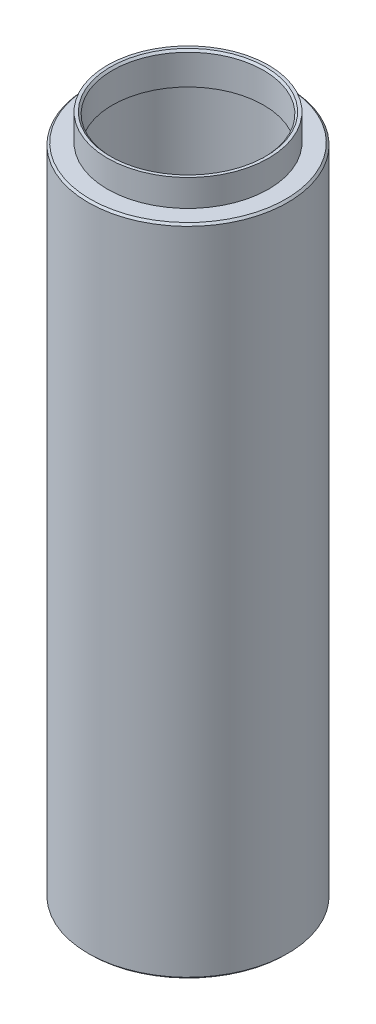
ISO-10303-21;
HEADER;
FILE_DESCRIPTION(('STEP AP214'),'2;1');
FILE_NAME('part.step','',(''),(''),'','','');
FILE_SCHEMA(('AUTOMOTIVE_DESIGN { 1 0 10303 214 1 1 1 1 }'));
ENDSEC;
DATA;
#1=APPLICATION_CONTEXT('core data for automotive mechanical design processes');
#2=APPLICATION_PROTOCOL_DEFINITION('international standard','automotive_design',2000,#1);
#3=PRODUCT_CONTEXT('',#1,'mechanical');
#4=PRODUCT('Part','Part','',(#3));
#5=PRODUCT_RELATED_PRODUCT_CATEGORY('part','',(#4));
#6=PRODUCT_DEFINITION_FORMATION('','',#4);
#7=PRODUCT_DEFINITION_CONTEXT('part definition',#1,'design');
#8=PRODUCT_DEFINITION('design','',#6,#7);
#9=PRODUCT_DEFINITION_SHAPE('','',#8);
#10=(LENGTH_UNIT() NAMED_UNIT(*) SI_UNIT(.MILLI.,.METRE.));
#11=(NAMED_UNIT(*) PLANE_ANGLE_UNIT() SI_UNIT($,.RADIAN.));
#12=(NAMED_UNIT(*) SI_UNIT($,.STERADIAN.) SOLID_ANGLE_UNIT());
#13=UNCERTAINTY_MEASURE_WITH_UNIT(LENGTH_MEASURE(1.E-05),#10,'distance_accuracy_value','');
#14=(GEOMETRIC_REPRESENTATION_CONTEXT(3) GLOBAL_UNCERTAINTY_ASSIGNED_CONTEXT((#13)) GLOBAL_UNIT_ASSIGNED_CONTEXT((#10,
#11,#12)) REPRESENTATION_CONTEXT('',''));
#15=CARTESIAN_POINT('',(0.,0.,0.));
#16=DIRECTION('',(0.,0.,1.));
#17=DIRECTION('',(1.,0.,0.));
#18=AXIS2_PLACEMENT_3D('',#15,#16,#17);
#19=CARTESIAN_POINT('',(14.95,0.,0.));
#20=DIRECTION('',(0.,-1.,0.));
#21=DIRECTION('',(0.,0.,-1.));
#22=AXIS2_PLACEMENT_3D('',#19,#20,#21);
#23=PLANE('',#22);
#24=CARTESIAN_POINT('',(0.,0.,0.));
#25=DIRECTION('',(0.,-1.,0.));
#26=DIRECTION('',(0.,0.,-1.));
#27=AXIS2_PLACEMENT_3D('',#24,#25,#26);
#28=CIRCLE('',#27,14.95);
#29=CARTESIAN_POINT('',(0.,0.,-14.95));
#30=VERTEX_POINT('',#29);
#31=EDGE_CURVE('E82',#30,#30,#28,.T.);
#32=ORIENTED_EDGE('',*,*,#31,.T.);
#33=EDGE_LOOP('',(#32));
#34=FACE_BOUND('',#33,.T.);
#35=CARTESIAN_POINT('',(0.,0.,0.));
#36=DIRECTION('',(0.,-1.,0.));
#37=DIRECTION('',(0.,0.,-1.));
#38=AXIS2_PLACEMENT_3D('',#35,#36,#37);
#39=CIRCLE('',#38,12.7);
#40=CARTESIAN_POINT('',(0.,0.,-12.7));
#41=VERTEX_POINT('',#40);
#42=EDGE_CURVE('E10',#41,#41,#39,.T.);
#43=ORIENTED_EDGE('',*,*,#42,.F.);
#44=EDGE_LOOP('',(#43));
#45=FACE_BOUND('',#44,.T.);
#46=ADVANCED_FACE('F36',(#34,#45),#23,.T.);
#47=CARTESIAN_POINT('',(0.,0.,0.));
#48=DIRECTION('',(0.,-1.,0.));
#49=DIRECTION('',(0.,0.,-1.));
#50=AXIS2_PLACEMENT_3D('',#47,#48,#49);
#51=CYLINDRICAL_SURFACE('',#50,12.7);
#52=ORIENTED_EDGE('',*,*,#42,.T.);
#53=EDGE_LOOP('',(#52));
#54=FACE_BOUND('',#53,.T.);
#55=CARTESIAN_POINT('',(0.,98.552,0.));
#56=DIRECTION('',(0.,-1.,0.));
#57=DIRECTION('',(0.,0.,-1.));
#58=AXIS2_PLACEMENT_3D('',#55,#56,#57);
#59=CIRCLE('',#58,12.7);
#60=CARTESIAN_POINT('',(0.,98.552,-12.7));
#61=VERTEX_POINT('',#60);
#62=EDGE_CURVE('E43',#61,#61,#59,.T.);
#63=ORIENTED_EDGE('',*,*,#62,.F.);
#64=EDGE_LOOP('',(#63));
#65=FACE_BOUND('',#64,.T.);
#66=ADVANCED_FACE('F100',(#54,#65),#51,.F.);
#67=CARTESIAN_POINT('',(12.7,98.552,0.));
#68=DIRECTION('',(0.,1.,0.));
#69=DIRECTION('',(0.,0.,1.));
#70=AXIS2_PLACEMENT_3D('',#67,#68,#69);
#71=PLANE('',#70);
#72=ORIENTED_EDGE('',*,*,#62,.T.);
#73=EDGE_LOOP('',(#72));
#74=FACE_BOUND('',#73,.T.);
#75=CARTESIAN_POINT('',(0.,98.552,0.));
#76=DIRECTION('',(0.,-1.,0.));
#77=DIRECTION('',(0.,0.,-1.));
#78=AXIS2_PLACEMENT_3D('',#75,#76,#77);
#79=CIRCLE('',#78,13.208);
#80=CARTESIAN_POINT('',(0.,98.552,-13.208));
#81=VERTEX_POINT('',#80);
#82=EDGE_CURVE('E48',#81,#81,#79,.T.);
#83=ORIENTED_EDGE('',*,*,#82,.F.);
#84=EDGE_LOOP('',(#83));
#85=FACE_BOUND('',#84,.T.);
#86=ADVANCED_FACE('F104',(#74,#85),#71,.T.);
#87=CARTESIAN_POINT('',(0.,0.,0.));
#88=DIRECTION('',(0.,-1.,0.));
#89=DIRECTION('',(0.,0.,-1.));
#90=AXIS2_PLACEMENT_3D('',#87,#88,#89);
#91=CYLINDRICAL_SURFACE('',#90,13.208);
#92=ORIENTED_EDGE('',*,*,#82,.T.);
#93=EDGE_LOOP('',(#92));
#94=FACE_BOUND('',#93,.T.);
#95=CARTESIAN_POINT('',(0.,99.2,0.));
#96=DIRECTION('',(0.,-1.,0.));
#97=DIRECTION('',(0.,0.,-1.));
#98=AXIS2_PLACEMENT_3D('',#95,#96,#97);
#99=CIRCLE('',#98,13.208);
#100=CARTESIAN_POINT('',(0.,99.2,-13.208));
#101=VERTEX_POINT('',#100);
#102=EDGE_CURVE('E52',#101,#101,#99,.T.);
#103=ORIENTED_EDGE('',*,*,#102,.F.);
#104=EDGE_LOOP('',(#103));
#105=FACE_BOUND('',#104,.T.);
#106=ADVANCED_FACE('F108',(#94,#105),#91,.F.);
#107=CARTESIAN_POINT('',(13.208,99.2,0.));
#108=DIRECTION('',(0.,-1.,0.));
#109=DIRECTION('',(0.,0.,-1.));
#110=AXIS2_PLACEMENT_3D('',#107,#108,#109);
#111=PLANE('',#110);
#112=ORIENTED_EDGE('',*,*,#102,.T.);
#113=EDGE_LOOP('',(#112));
#114=FACE_BOUND('',#113,.T.);
#115=CARTESIAN_POINT('',(0.,99.2,0.));
#116=DIRECTION('',(0.,-1.,0.));
#117=DIRECTION('',(0.,0.,-1.));
#118=AXIS2_PLACEMENT_3D('',#115,#116,#117);
#119=CIRCLE('',#118,11.557);
#120=CARTESIAN_POINT('',(0.,99.2,-11.557));
#121=VERTEX_POINT('',#120);
#122=EDGE_CURVE('E57',#121,#121,#119,.T.);
#123=ORIENTED_EDGE('',*,*,#122,.F.);
#124=EDGE_LOOP('',(#123));
#125=FACE_BOUND('',#124,.T.);
#126=ADVANCED_FACE('F114',(#114,#125),#111,.T.);
#127=CARTESIAN_POINT('',(0.,0.,0.));
#128=DIRECTION('',(0.,-1.,0.));
#129=DIRECTION('',(0.,0.,-1.));
#130=AXIS2_PLACEMENT_3D('',#127,#128,#129);
#131=CYLINDRICAL_SURFACE('',#130,11.557);
#132=ORIENTED_EDGE('',*,*,#122,.T.);
#133=EDGE_LOOP('',(#132));
#134=FACE_BOUND('',#133,.T.);
#135=CARTESIAN_POINT('',(0.,103.8,0.));
#136=DIRECTION('',(0.,-1.,0.));
#137=DIRECTION('',(0.,0.,-1.));
#138=AXIS2_PLACEMENT_3D('',#135,#136,#137);
#139=CIRCLE('',#138,11.557);
#140=CARTESIAN_POINT('',(0.,103.8,-11.557));
#141=VERTEX_POINT('',#140);
#142=EDGE_CURVE('E60',#141,#141,#139,.T.);
#143=ORIENTED_EDGE('',*,*,#142,.F.);
#144=EDGE_LOOP('',(#143));
#145=FACE_BOUND('',#144,.T.);
#146=ADVANCED_FACE('F118',(#134,#145),#131,.F.);
#147=CARTESIAN_POINT('',(0.,104.1,0.));
#148=DIRECTION('',(0.,1.,0.));
#149=DIRECTION('',(0.,0.,1.));
#150=AXIS2_PLACEMENT_3D('',#147,#148,#149);
#151=CONICAL_SURFACE('',#150,11.857,0.785398163397457);
#152=ORIENTED_EDGE('',*,*,#142,.T.);
#153=EDGE_LOOP('',(#152));
#154=FACE_BOUND('',#153,.T.);
#155=CARTESIAN_POINT('',(0.,104.1,0.));
#156=DIRECTION('',(0.,-1.,0.));
#157=DIRECTION('',(0.,0.,-1.));
#158=AXIS2_PLACEMENT_3D('',#155,#156,#157);
#159=CIRCLE('',#158,11.857);
#160=CARTESIAN_POINT('',(0.,104.1,-11.857));
#161=VERTEX_POINT('',#160);
#162=EDGE_CURVE('E63',#161,#161,#159,.T.);
#163=ORIENTED_EDGE('',*,*,#162,.F.);
#164=EDGE_LOOP('',(#163));
#165=FACE_BOUND('',#164,.T.);
#166=ADVANCED_FACE('F122',(#154,#165),#151,.F.);
#167=CARTESIAN_POINT('',(11.857,104.1,0.));
#168=DIRECTION('',(0.,1.,0.));
#169=DIRECTION('',(0.,0.,1.));
#170=AXIS2_PLACEMENT_3D('',#167,#168,#169);
#171=PLANE('',#170);
#172=ORIENTED_EDGE('',*,*,#162,.T.);
#173=EDGE_LOOP('',(#172));
#174=FACE_BOUND('',#173,.T.);
#175=CARTESIAN_POINT('',(0.,104.1,0.));
#176=DIRECTION('',(0.,-1.,0.));
#177=DIRECTION('',(0.,0.,-1.));
#178=AXIS2_PLACEMENT_3D('',#175,#176,#177);
#179=CIRCLE('',#178,12.319);
#180=CARTESIAN_POINT('',(0.,104.1,-12.319));
#181=VERTEX_POINT('',#180);
#182=EDGE_CURVE('E66',#181,#181,#179,.T.);
#183=ORIENTED_EDGE('',*,*,#182,.F.);
#184=EDGE_LOOP('',(#183));
#185=FACE_BOUND('',#184,.T.);
#186=ADVANCED_FACE('F126',(#174,#185),#171,.T.);
#187=CARTESIAN_POINT('',(0.,0.,0.));
#188=DIRECTION('',(0.,-1.,0.));
#189=DIRECTION('',(0.,0.,-1.));
#190=AXIS2_PLACEMENT_3D('',#187,#188,#189);
#191=CYLINDRICAL_SURFACE('',#190,12.319);
#192=ORIENTED_EDGE('',*,*,#182,.T.);
#193=EDGE_LOOP('',(#192));
#194=FACE_BOUND('',#193,.T.);
#195=CARTESIAN_POINT('',(0.,100.,0.));
#196=DIRECTION('',(0.,-1.,0.));
#197=DIRECTION('',(0.,0.,-1.));
#198=AXIS2_PLACEMENT_3D('',#195,#196,#197);
#199=CIRCLE('',#198,12.319);
#200=CARTESIAN_POINT('',(0.,100.,-12.319));
#201=VERTEX_POINT('',#200);
#202=EDGE_CURVE('E69',#201,#201,#199,.T.);
#203=ORIENTED_EDGE('',*,*,#202,.F.);
#204=EDGE_LOOP('',(#203));
#205=FACE_BOUND('',#204,.T.);
#206=ADVANCED_FACE('F130',(#194,#205),#191,.T.);
#207=CARTESIAN_POINT('',(12.319,100.,0.));
#208=DIRECTION('',(0.,1.,0.));
#209=DIRECTION('',(0.,0.,1.));
#210=AXIS2_PLACEMENT_3D('',#207,#208,#209);
#211=PLANE('',#210);
#212=ORIENTED_EDGE('',*,*,#202,.T.);
#213=EDGE_LOOP('',(#212));
#214=FACE_BOUND('',#213,.T.);
#215=CARTESIAN_POINT('',(0.,100.,0.));
#216=DIRECTION('',(0.,-1.,0.));
#217=DIRECTION('',(0.,0.,-1.));
#218=AXIS2_PLACEMENT_3D('',#215,#216,#217);
#219=CIRCLE('',#218,14.95);
#220=CARTESIAN_POINT('',(0.,100.,-14.95));
#221=VERTEX_POINT('',#220);
#222=EDGE_CURVE('E72',#221,#221,#219,.T.);
#223=ORIENTED_EDGE('',*,*,#222,.F.);
#224=EDGE_LOOP('',(#223));
#225=FACE_BOUND('',#224,.T.);
#226=ADVANCED_FACE('F134',(#214,#225),#211,.T.);
#227=CARTESIAN_POINT('',(0.,99.7,0.));
#228=DIRECTION('',(0.,-1.,0.));
#229=DIRECTION('',(0.,0.,-1.));
#230=AXIS2_PLACEMENT_3D('',#227,#228,#229);
#231=CONICAL_SURFACE('',#230,15.25,0.785398163397457);
#232=ORIENTED_EDGE('',*,*,#222,.T.);
#233=EDGE_LOOP('',(#232));
#234=FACE_BOUND('',#233,.T.);
#235=CARTESIAN_POINT('',(0.,99.7,0.));
#236=DIRECTION('',(0.,-1.,0.));
#237=DIRECTION('',(0.,0.,-1.));
#238=AXIS2_PLACEMENT_3D('',#235,#236,#237);
#239=CIRCLE('',#238,15.25);
#240=CARTESIAN_POINT('',(0.,99.7,-15.25));
#241=VERTEX_POINT('',#240);
#242=EDGE_CURVE('E75',#241,#241,#239,.T.);
#243=ORIENTED_EDGE('',*,*,#242,.F.);
#244=EDGE_LOOP('',(#243));
#245=FACE_BOUND('',#244,.T.);
#246=ADVANCED_FACE('F96',(#234,#245),#231,.T.);
#247=CARTESIAN_POINT('',(0.,0.,0.));
#248=DIRECTION('',(0.,-1.,0.));
#249=DIRECTION('',(0.,0.,-1.));
#250=AXIS2_PLACEMENT_3D('',#247,#248,#249);
#251=CYLINDRICAL_SURFACE('',#250,15.25);
#252=ORIENTED_EDGE('',*,*,#242,.T.);
#253=EDGE_LOOP('',(#252));
#254=FACE_BOUND('',#253,.T.);
#255=CARTESIAN_POINT('',(0.,0.300000000000002,0.));
#256=DIRECTION('',(0.,-1.,0.));
#257=DIRECTION('',(0.,0.,-1.));
#258=AXIS2_PLACEMENT_3D('',#255,#256,#257);
#259=CIRCLE('',#258,15.25);
#260=CARTESIAN_POINT('',(0.,0.300000000000002,-15.25));
#261=VERTEX_POINT('',#260);
#262=EDGE_CURVE('E78',#261,#261,#259,.T.);
#263=ORIENTED_EDGE('',*,*,#262,.F.);
#264=EDGE_LOOP('',(#263));
#265=FACE_BOUND('',#264,.T.);
#266=ADVANCED_FACE('F90',(#254,#265),#251,.T.);
#267=CARTESIAN_POINT('',(0.,0.,0.));
#268=DIRECTION('',(0.,1.,0.));
#269=DIRECTION('',(0.,0.,1.));
#270=AXIS2_PLACEMENT_3D('',#267,#268,#269);
#271=CONICAL_SURFACE('',#270,14.95,0.785398163397448);
#272=ORIENTED_EDGE('',*,*,#262,.T.);
#273=EDGE_LOOP('',(#272));
#274=FACE_BOUND('',#273,.T.);
#275=ORIENTED_EDGE('',*,*,#31,.F.);
#276=EDGE_LOOP('',(#275));
#277=FACE_BOUND('',#276,.T.);
#278=ADVANCED_FACE('F88',(#274,#277),#271,.T.);
#279=CLOSED_SHELL('',(#46,#66,#86,#106,#126,#146,#166,#186,#206,#226,#246,#266,#278));
#280=MANIFOLD_SOLID_BREP('B2',#279);
#281=ADVANCED_BREP_SHAPE_REPRESENTATION('',(#18,#280),#14);
#282=SHAPE_DEFINITION_REPRESENTATION(#9,#281);
ENDSEC;
END-ISO-10303-21;
